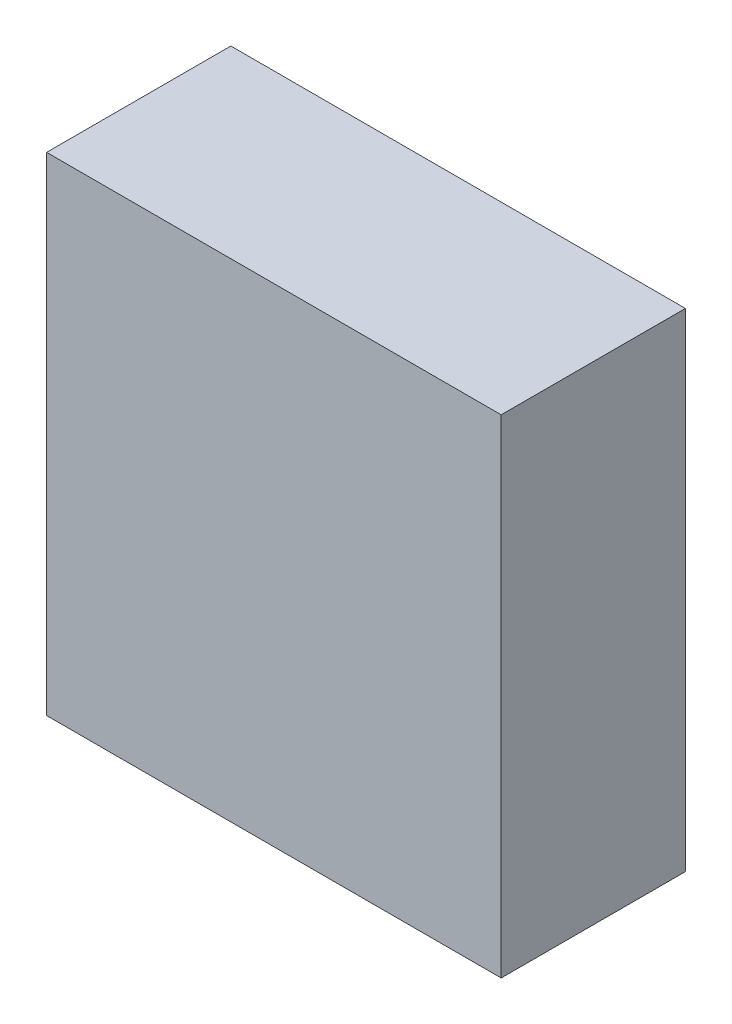
ISO-10303-21;
HEADER;
FILE_DESCRIPTION(('STEP AP214'),'2;1');
FILE_NAME('part.step','',(''),(''),'','','');
FILE_SCHEMA(('AUTOMOTIVE_DESIGN { 1 0 10303 214 1 1 1 1 }'));
ENDSEC;
DATA;
#1=APPLICATION_CONTEXT('core data for automotive mechanical design processes');
#2=APPLICATION_PROTOCOL_DEFINITION('international standard','automotive_design',2000,#1);
#3=PRODUCT_CONTEXT('',#1,'mechanical');
#4=PRODUCT('Part','Part','',(#3));
#5=PRODUCT_RELATED_PRODUCT_CATEGORY('part','',(#4));
#6=PRODUCT_DEFINITION_FORMATION('','',#4);
#7=PRODUCT_DEFINITION_CONTEXT('part definition',#1,'design');
#8=PRODUCT_DEFINITION('design','',#6,#7);
#9=PRODUCT_DEFINITION_SHAPE('','',#8);
#10=(LENGTH_UNIT() NAMED_UNIT(*) SI_UNIT(.MILLI.,.METRE.));
#11=(NAMED_UNIT(*) PLANE_ANGLE_UNIT() SI_UNIT($,.RADIAN.));
#12=(NAMED_UNIT(*) SI_UNIT($,.STERADIAN.) SOLID_ANGLE_UNIT());
#13=UNCERTAINTY_MEASURE_WITH_UNIT(LENGTH_MEASURE(1.E-05),#10,'distance_accuracy_value','');
#14=(GEOMETRIC_REPRESENTATION_CONTEXT(3) GLOBAL_UNCERTAINTY_ASSIGNED_CONTEXT((#13)) GLOBAL_UNIT_ASSIGNED_CONTEXT((#10,
#11,#12)) REPRESENTATION_CONTEXT('',''));
#15=CARTESIAN_POINT('',(0.,0.,0.));
#16=DIRECTION('',(0.,0.,1.));
#17=DIRECTION('',(1.,0.,0.));
#18=AXIS2_PLACEMENT_3D('',#15,#16,#17);
#19=CARTESIAN_POINT('',(-1.60000610351563,3.27000427246094,-4.61112093925476));
#20=DIRECTION('',(-1.,0.,0.));
#21=DIRECTION('',(0.,-1.,0.));
#22=AXIS2_PLACEMENT_3D('',#19,#20,#21);
#23=PLANE('',#22);
#24=DIRECTION('',(0.,-1.,0.));
#25=VECTOR('',#24,1.);
#26=CARTESIAN_POINT('',(-1.60000610351563,3.27000427246094,-4.61112093925476));
#27=LINE('',#26,#25);
#28=CARTESIAN_POINT('',(-1.60000610351563,3.27000427246094,-4.61112093925476));
#29=VERTEX_POINT('',#28);
#30=CARTESIAN_POINT('',(-1.60000610351563,-3.26998901367187,-4.61112093925476));
#31=VERTEX_POINT('',#30);
#32=EDGE_CURVE('E11',#29,#31,#27,.T.);
#33=ORIENTED_EDGE('',*,*,#32,.T.);
#34=DIRECTION('',(0.,0.,1.));
#35=VECTOR('',#34,1.);
#36=CARTESIAN_POINT('',(-1.60000610351563,-3.26998901367187,-4.61112093925476));
#37=LINE('',#36,#35);
#38=CARTESIAN_POINT('',(-1.60000610351563,-3.26998901367187,-2.14112091064453));
#39=VERTEX_POINT('',#38);
#40=EDGE_CURVE('E88',#31,#39,#37,.T.);
#41=ORIENTED_EDGE('',*,*,#40,.T.);
#42=DIRECTION('',(0.,-1.,0.));
#43=VECTOR('',#42,1.);
#44=CARTESIAN_POINT('',(-1.60000610351563,3.27000427246094,-2.14112091064453));
#45=LINE('',#44,#43);
#46=CARTESIAN_POINT('',(-1.60000610351563,3.27000427246094,-2.14112091064453));
#47=VERTEX_POINT('',#46);
#48=EDGE_CURVE('E83',#47,#39,#45,.T.);
#49=ORIENTED_EDGE('',*,*,#48,.F.);
#50=DIRECTION('',(0.,0.,1.));
#51=VECTOR('',#50,1.);
#52=CARTESIAN_POINT('',(-1.60000610351562,3.27000427246094,-4.61112093925476));
#53=LINE('',#52,#51);
#54=EDGE_CURVE('E72',#29,#47,#53,.T.);
#55=ORIENTED_EDGE('',*,*,#54,.F.);
#56=EDGE_LOOP('',(#33,#41,#49,#55));
#57=FACE_BOUND('',#56,.T.);
#58=ADVANCED_FACE('F17',(#57),#23,.T.);
#59=CARTESIAN_POINT('',(-1.60000610351563,-3.26998901367187,-4.61112093925476));
#60=DIRECTION('',(0.,-1.,0.));
#61=DIRECTION('',(1.,0.,0.));
#62=AXIS2_PLACEMENT_3D('',#59,#60,#61);
#63=PLANE('',#62);
#64=DIRECTION('',(1.,0.,0.));
#65=VECTOR('',#64,1.);
#66=CARTESIAN_POINT('',(-1.60000610351563,-3.26998901367187,-4.61112093925476));
#67=LINE('',#66,#65);
#68=CARTESIAN_POINT('',(4.49502563476563,-3.26998901367187,-4.61112093925476));
#69=VERTEX_POINT('',#68);
#70=EDGE_CURVE('E24',#31,#69,#67,.T.);
#71=ORIENTED_EDGE('',*,*,#70,.T.);
#72=DIRECTION('',(0.,0.,1.));
#73=VECTOR('',#72,1.);
#74=CARTESIAN_POINT('',(4.49502563476562,-3.26998901367187,-4.61112093925476));
#75=LINE('',#74,#73);
#76=CARTESIAN_POINT('',(4.49502563476563,-3.26998901367187,-2.14112091064453));
#77=VERTEX_POINT('',#76);
#78=EDGE_CURVE('E85',#69,#77,#75,.T.);
#79=ORIENTED_EDGE('',*,*,#78,.T.);
#80=DIRECTION('',(1.,0.,0.));
#81=VECTOR('',#80,1.);
#82=CARTESIAN_POINT('',(-1.60000610351563,-3.26998901367187,-2.14112091064453));
#83=LINE('',#82,#81);
#84=EDGE_CURVE('E66',#39,#77,#83,.T.);
#85=ORIENTED_EDGE('',*,*,#84,.F.);
#86=ORIENTED_EDGE('',*,*,#40,.F.);
#87=EDGE_LOOP('',(#71,#79,#85,#86));
#88=FACE_BOUND('',#87,.T.);
#89=ADVANCED_FACE('F89',(#88),#63,.T.);
#90=CARTESIAN_POINT('',(4.49502563476563,-3.26998901367187,-4.61112093925476));
#91=DIRECTION('',(1.,0.,0.));
#92=DIRECTION('',(0.,1.,0.));
#93=AXIS2_PLACEMENT_3D('',#90,#91,#92);
#94=PLANE('',#93);
#95=DIRECTION('',(0.,1.,0.));
#96=VECTOR('',#95,1.);
#97=CARTESIAN_POINT('',(4.49502563476563,-3.26998901367187,-4.61112093925476));
#98=LINE('',#97,#96);
#99=CARTESIAN_POINT('',(4.49502563476563,3.27000427246094,-4.61112093925476));
#100=VERTEX_POINT('',#99);
#101=EDGE_CURVE('E62',#69,#100,#98,.T.);
#102=ORIENTED_EDGE('',*,*,#101,.T.);
#103=DIRECTION('',(0.,0.,1.));
#104=VECTOR('',#103,1.);
#105=CARTESIAN_POINT('',(4.49502563476563,3.27000427246094,-4.61112093925476));
#106=LINE('',#105,#104);
#107=CARTESIAN_POINT('',(4.49502563476563,3.27000427246094,-2.14112091064453));
#108=VERTEX_POINT('',#107);
#109=EDGE_CURVE('E55',#100,#108,#106,.T.);
#110=ORIENTED_EDGE('',*,*,#109,.T.);
#111=DIRECTION('',(0.,1.,0.));
#112=VECTOR('',#111,1.);
#113=CARTESIAN_POINT('',(4.49502563476563,-3.26998901367187,-2.14112091064453));
#114=LINE('',#113,#112);
#115=EDGE_CURVE('E59',#77,#108,#114,.T.);
#116=ORIENTED_EDGE('',*,*,#115,.F.);
#117=ORIENTED_EDGE('',*,*,#78,.F.);
#118=EDGE_LOOP('',(#102,#110,#116,#117));
#119=FACE_BOUND('',#118,.T.);
#120=ADVANCED_FACE('F57',(#119),#94,.T.);
#121=CARTESIAN_POINT('',(4.49502563476563,3.27000427246094,-4.61112093925476));
#122=DIRECTION('',(0.,1.,0.));
#123=DIRECTION('',(-1.,0.,0.));
#124=AXIS2_PLACEMENT_3D('',#121,#122,#123);
#125=PLANE('',#124);
#126=DIRECTION('',(-1.,0.,0.));
#127=VECTOR('',#126,1.);
#128=CARTESIAN_POINT('',(4.49502563476563,3.27000427246094,-4.61112093925476));
#129=LINE('',#128,#127);
#130=EDGE_CURVE('E65',#100,#29,#129,.T.);
#131=ORIENTED_EDGE('',*,*,#130,.T.);
#132=ORIENTED_EDGE('',*,*,#54,.T.);
#133=DIRECTION('',(-1.,0.,0.));
#134=VECTOR('',#133,1.);
#135=CARTESIAN_POINT('',(4.49502563476563,3.27000427246094,-2.14112091064453));
#136=LINE('',#135,#134);
#137=EDGE_CURVE('E70',#108,#47,#136,.T.);
#138=ORIENTED_EDGE('',*,*,#137,.F.);
#139=ORIENTED_EDGE('',*,*,#109,.F.);
#140=EDGE_LOOP('',(#131,#132,#138,#139));
#141=FACE_BOUND('',#140,.T.);
#142=ADVANCED_FACE('F71',(#141),#125,.T.);
#143=CARTESIAN_POINT('',(-374.524993896484,-121.524993896484,-2.14112091064453));
#144=DIRECTION('',(0.,0.,1.));
#145=DIRECTION('',(1.,0.,0.));
#146=AXIS2_PLACEMENT_3D('',#143,#144,#145);
#147=PLANE('',#146);
#148=ORIENTED_EDGE('',*,*,#48,.T.);
#149=ORIENTED_EDGE('',*,*,#84,.T.);
#150=ORIENTED_EDGE('',*,*,#115,.T.);
#151=ORIENTED_EDGE('',*,*,#137,.T.);
#152=EDGE_LOOP('',(#148,#149,#150,#151));
#153=FACE_BOUND('',#152,.T.);
#154=ADVANCED_FACE('F76',(#153),#147,.T.);
#155=CARTESIAN_POINT('',(-374.524993896484,-121.524993896484,-4.61112093925476));
#156=DIRECTION('',(0.,0.,1.));
#157=DIRECTION('',(1.,0.,0.));
#158=AXIS2_PLACEMENT_3D('',#155,#156,#157);
#159=PLANE('',#158);
#160=ORIENTED_EDGE('',*,*,#130,.F.);
#161=ORIENTED_EDGE('',*,*,#101,.F.);
#162=ORIENTED_EDGE('',*,*,#70,.F.);
#163=ORIENTED_EDGE('',*,*,#32,.F.);
#164=EDGE_LOOP('',(#160,#161,#162,#163));
#165=FACE_BOUND('',#164,.T.);
#166=ADVANCED_FACE('F91',(#165),#159,.F.);
#167=CLOSED_SHELL('',(#58,#89,#120,#142,#154,#166));
#168=MANIFOLD_SOLID_BREP('B1',#167);
#169=ADVANCED_BREP_SHAPE_REPRESENTATION('',(#18,#168),#14);
#170=SHAPE_DEFINITION_REPRESENTATION(#9,#169);
ENDSEC;
END-ISO-10303-21;
